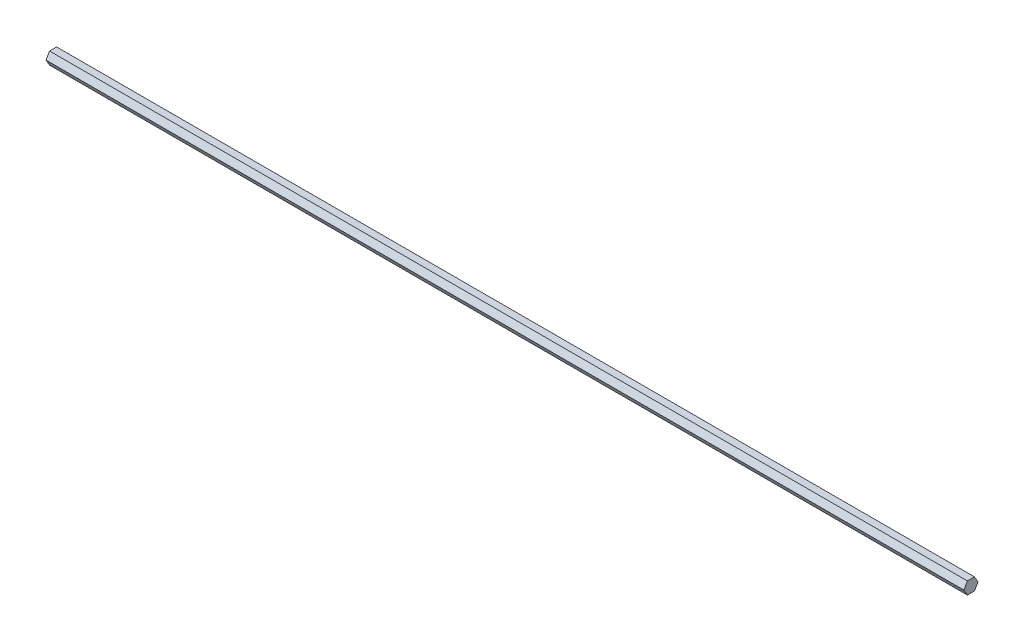
ISO-10303-21;
HEADER;
FILE_DESCRIPTION(('STEP AP214'),'2;1');
FILE_NAME('part.step','',(''),(''),'','','');
FILE_SCHEMA(('AUTOMOTIVE_DESIGN { 1 0 10303 214 1 1 1 1 }'));
ENDSEC;
DATA;
#1=APPLICATION_CONTEXT('core data for automotive mechanical design processes');
#2=APPLICATION_PROTOCOL_DEFINITION('international standard','automotive_design',2000,#1);
#3=PRODUCT_CONTEXT('',#1,'mechanical');
#4=PRODUCT('Part','Part','',(#3));
#5=PRODUCT_RELATED_PRODUCT_CATEGORY('part','',(#4));
#6=PRODUCT_DEFINITION_FORMATION('','',#4);
#7=PRODUCT_DEFINITION_CONTEXT('part definition',#1,'design');
#8=PRODUCT_DEFINITION('design','',#6,#7);
#9=PRODUCT_DEFINITION_SHAPE('','',#8);
#10=(LENGTH_UNIT() NAMED_UNIT(*) SI_UNIT(.MILLI.,.METRE.));
#11=(NAMED_UNIT(*) PLANE_ANGLE_UNIT() SI_UNIT($,.RADIAN.));
#12=(NAMED_UNIT(*) SI_UNIT($,.STERADIAN.) SOLID_ANGLE_UNIT());
#13=UNCERTAINTY_MEASURE_WITH_UNIT(LENGTH_MEASURE(1.E-05),#10,'distance_accuracy_value','');
#14=(GEOMETRIC_REPRESENTATION_CONTEXT(3) GLOBAL_UNCERTAINTY_ASSIGNED_CONTEXT((#13)) GLOBAL_UNIT_ASSIGNED_CONTEXT((#10,
#11,#12)) REPRESENTATION_CONTEXT('',''));
#15=CARTESIAN_POINT('',(0.,0.,0.));
#16=DIRECTION('',(0.,0.,1.));
#17=DIRECTION('',(1.,0.,0.));
#18=AXIS2_PLACEMENT_3D('',#15,#16,#17);
#19=CARTESIAN_POINT('',(75.,-1.,-0.577350269189626));
#20=DIRECTION('',(0.,0.5,0.866025403784439));
#21=DIRECTION('',(0.,-0.866025403784439,0.5));
#22=AXIS2_PLACEMENT_3D('',#19,#20,#21);
#23=PLANE('',#22);
#24=DIRECTION('',(0.,0.866025403784439,-0.5));
#25=VECTOR('',#24,1.);
#26=CARTESIAN_POINT('',(-75.,-1.,-0.577350269189626));
#27=LINE('',#26,#25);
#28=CARTESIAN_POINT('',(-75.,-1.,-0.577350269189626));
#29=VERTEX_POINT('',#28);
#30=CARTESIAN_POINT('',(-75.,0.,-1.15470053837925));
#31=VERTEX_POINT('',#30);
#32=EDGE_CURVE('E120',#29,#31,#27,.T.);
#33=ORIENTED_EDGE('',*,*,#32,.T.);
#34=DIRECTION('',(-1.,0.,0.));
#35=VECTOR('',#34,1.);
#36=CARTESIAN_POINT('',(75.,0.,-1.15470053837925));
#37=LINE('',#36,#35);
#38=CARTESIAN_POINT('',(75.,0.,-1.15470053837925));
#39=VERTEX_POINT('',#38);
#40=EDGE_CURVE('E11',#39,#31,#37,.T.);
#41=ORIENTED_EDGE('',*,*,#40,.F.);
#42=DIRECTION('',(0.,0.866025403784439,-0.5));
#43=VECTOR('',#42,1.);
#44=CARTESIAN_POINT('',(75.,-1.,-0.577350269189626));
#45=LINE('',#44,#43);
#46=CARTESIAN_POINT('',(75.,-1.,-0.577350269189626));
#47=VERTEX_POINT('',#46);
#48=EDGE_CURVE('E130',#47,#39,#45,.T.);
#49=ORIENTED_EDGE('',*,*,#48,.F.);
#50=DIRECTION('',(-1.,0.,0.));
#51=VECTOR('',#50,1.);
#52=CARTESIAN_POINT('',(75.,-1.,-0.577350269189626));
#53=LINE('',#52,#51);
#54=EDGE_CURVE('E116',#47,#29,#53,.T.);
#55=ORIENTED_EDGE('',*,*,#54,.T.);
#56=EDGE_LOOP('',(#33,#41,#49,#55));
#57=FACE_BOUND('',#56,.T.);
#58=ADVANCED_FACE('F36',(#57),#23,.F.);
#59=CARTESIAN_POINT('',(75.,0.,-1.15470053837925));
#60=DIRECTION('',(0.,-0.5,0.866025403784439));
#61=DIRECTION('',(0.,-0.866025403784439,-0.5));
#62=AXIS2_PLACEMENT_3D('',#59,#60,#61);
#63=PLANE('',#62);
#64=DIRECTION('',(0.,0.866025403784439,0.5));
#65=VECTOR('',#64,1.);
#66=CARTESIAN_POINT('',(-75.,0.,-1.15470053837925));
#67=LINE('',#66,#65);
#68=CARTESIAN_POINT('',(-75.,1.,-0.577350269189625));
#69=VERTEX_POINT('',#68);
#70=EDGE_CURVE('E123',#31,#69,#67,.T.);
#71=ORIENTED_EDGE('',*,*,#70,.T.);
#72=DIRECTION('',(-1.,0.,0.));
#73=VECTOR('',#72,1.);
#74=CARTESIAN_POINT('',(75.,1.,-0.577350269189625));
#75=LINE('',#74,#73);
#76=CARTESIAN_POINT('',(75.,1.,-0.577350269189625));
#77=VERTEX_POINT('',#76);
#78=EDGE_CURVE('E44',#77,#69,#75,.T.);
#79=ORIENTED_EDGE('',*,*,#78,.F.);
#80=DIRECTION('',(0.,0.866025403784439,0.5));
#81=VECTOR('',#80,1.);
#82=CARTESIAN_POINT('',(75.,0.,-1.15470053837925));
#83=LINE('',#82,#81);
#84=EDGE_CURVE('E89',#39,#77,#83,.T.);
#85=ORIENTED_EDGE('',*,*,#84,.F.);
#86=ORIENTED_EDGE('',*,*,#40,.T.);
#87=EDGE_LOOP('',(#71,#79,#85,#86));
#88=FACE_BOUND('',#87,.T.);
#89=ADVANCED_FACE('F154',(#88),#63,.F.);
#90=CARTESIAN_POINT('',(75.,1.,-0.577350269189625));
#91=DIRECTION('',(0.,-1.,0.));
#92=DIRECTION('',(0.,0.,-1.));
#93=AXIS2_PLACEMENT_3D('',#90,#91,#92);
#94=PLANE('',#93);
#95=DIRECTION('',(0.,0.,1.));
#96=VECTOR('',#95,1.);
#97=CARTESIAN_POINT('',(-75.,1.,-0.577350269189625));
#98=LINE('',#97,#96);
#99=CARTESIAN_POINT('',(-75.,1.,0.577350269189626));
#100=VERTEX_POINT('',#99);
#101=EDGE_CURVE('E125',#69,#100,#98,.T.);
#102=ORIENTED_EDGE('',*,*,#101,.T.);
#103=DIRECTION('',(-1.,0.,0.));
#104=VECTOR('',#103,1.);
#105=CARTESIAN_POINT('',(75.,1.,0.577350269189626));
#106=LINE('',#105,#104);
#107=CARTESIAN_POINT('',(75.,1.,0.577350269189626));
#108=VERTEX_POINT('',#107);
#109=EDGE_CURVE('E111',#108,#100,#106,.T.);
#110=ORIENTED_EDGE('',*,*,#109,.F.);
#111=DIRECTION('',(0.,0.,1.));
#112=VECTOR('',#111,1.);
#113=CARTESIAN_POINT('',(75.,1.,-0.577350269189625));
#114=LINE('',#113,#112);
#115=EDGE_CURVE('E102',#77,#108,#114,.T.);
#116=ORIENTED_EDGE('',*,*,#115,.F.);
#117=ORIENTED_EDGE('',*,*,#78,.T.);
#118=EDGE_LOOP('',(#102,#110,#116,#117));
#119=FACE_BOUND('',#118,.T.);
#120=ADVANCED_FACE('F136',(#119),#94,.F.);
#121=CARTESIAN_POINT('',(75.,1.,0.577350269189626));
#122=DIRECTION('',(0.,-0.5,-0.866025403784439));
#123=DIRECTION('',(0.,0.866025403784439,-0.5));
#124=AXIS2_PLACEMENT_3D('',#121,#122,#123);
#125=PLANE('',#124);
#126=DIRECTION('',(0.,-0.866025403784439,0.5));
#127=VECTOR('',#126,1.);
#128=CARTESIAN_POINT('',(-75.,1.,0.577350269189626));
#129=LINE('',#128,#127);
#130=CARTESIAN_POINT('',(-75.,0.,1.15470053837925));
#131=VERTEX_POINT('',#130);
#132=EDGE_CURVE('E110',#100,#131,#129,.T.);
#133=ORIENTED_EDGE('',*,*,#132,.T.);
#134=DIRECTION('',(-1.,0.,0.));
#135=VECTOR('',#134,1.);
#136=CARTESIAN_POINT('',(75.,0.,1.15470053837925));
#137=LINE('',#136,#135);
#138=CARTESIAN_POINT('',(75.,0.,1.15470053837925));
#139=VERTEX_POINT('',#138);
#140=EDGE_CURVE('E107',#139,#131,#137,.T.);
#141=ORIENTED_EDGE('',*,*,#140,.F.);
#142=DIRECTION('',(0.,-0.866025403784439,0.5));
#143=VECTOR('',#142,1.);
#144=CARTESIAN_POINT('',(75.,1.,0.577350269189626));
#145=LINE('',#144,#143);
#146=EDGE_CURVE('E96',#108,#139,#145,.T.);
#147=ORIENTED_EDGE('',*,*,#146,.F.);
#148=ORIENTED_EDGE('',*,*,#109,.T.);
#149=EDGE_LOOP('',(#133,#141,#147,#148));
#150=FACE_BOUND('',#149,.T.);
#151=ADVANCED_FACE('F108',(#150),#125,.F.);
#152=CARTESIAN_POINT('',(75.,0.,1.15470053837925));
#153=DIRECTION('',(0.,0.5,-0.866025403784439));
#154=DIRECTION('',(0.,0.866025403784439,0.5));
#155=AXIS2_PLACEMENT_3D('',#152,#153,#154);
#156=PLANE('',#155);
#157=DIRECTION('',(0.,-0.866025403784439,-0.5));
#158=VECTOR('',#157,1.);
#159=CARTESIAN_POINT('',(-75.,0.,1.15470053837925));
#160=LINE('',#159,#158);
#161=CARTESIAN_POINT('',(-75.,-1.,0.577350269189626));
#162=VERTEX_POINT('',#161);
#163=EDGE_CURVE('E75',#131,#162,#160,.T.);
#164=ORIENTED_EDGE('',*,*,#163,.T.);
#165=DIRECTION('',(-1.,0.,0.));
#166=VECTOR('',#165,1.);
#167=CARTESIAN_POINT('',(75.,-1.,0.577350269189626));
#168=LINE('',#167,#166);
#169=CARTESIAN_POINT('',(75.,-1.,0.577350269189626));
#170=VERTEX_POINT('',#169);
#171=EDGE_CURVE('E112',#170,#162,#168,.T.);
#172=ORIENTED_EDGE('',*,*,#171,.F.);
#173=DIRECTION('',(0.,-0.866025403784439,-0.5));
#174=VECTOR('',#173,1.);
#175=CARTESIAN_POINT('',(75.,0.,1.15470053837925));
#176=LINE('',#175,#174);
#177=EDGE_CURVE('E100',#139,#170,#176,.T.);
#178=ORIENTED_EDGE('',*,*,#177,.F.);
#179=ORIENTED_EDGE('',*,*,#140,.T.);
#180=EDGE_LOOP('',(#164,#172,#178,#179));
#181=FACE_BOUND('',#180,.T.);
#182=ADVANCED_FACE('F114',(#181),#156,.F.);
#183=CARTESIAN_POINT('',(75.,-1.,0.577350269189626));
#184=DIRECTION('',(0.,1.,0.));
#185=DIRECTION('',(0.,0.,1.));
#186=AXIS2_PLACEMENT_3D('',#183,#184,#185);
#187=PLANE('',#186);
#188=DIRECTION('',(0.,0.,-1.));
#189=VECTOR('',#188,1.);
#190=CARTESIAN_POINT('',(-75.,-1.,0.577350269189626));
#191=LINE('',#190,#189);
#192=EDGE_CURVE('E81',#162,#29,#191,.T.);
#193=ORIENTED_EDGE('',*,*,#192,.T.);
#194=ORIENTED_EDGE('',*,*,#54,.F.);
#195=DIRECTION('',(0.,0.,-1.));
#196=VECTOR('',#195,1.);
#197=CARTESIAN_POINT('',(75.,-1.,0.577350269189626));
#198=LINE('',#197,#196);
#199=EDGE_CURVE('E52',#170,#47,#198,.T.);
#200=ORIENTED_EDGE('',*,*,#199,.F.);
#201=ORIENTED_EDGE('',*,*,#171,.T.);
#202=EDGE_LOOP('',(#193,#194,#200,#201));
#203=FACE_BOUND('',#202,.T.);
#204=ADVANCED_FACE('F143',(#203),#187,.F.);
#205=CARTESIAN_POINT('',(75.,0.,0.));
#206=DIRECTION('',(1.,0.,0.));
#207=DIRECTION('',(0.,0.,-1.));
#208=AXIS2_PLACEMENT_3D('',#205,#206,#207);
#209=PLANE('',#208);
#210=ORIENTED_EDGE('',*,*,#48,.T.);
#211=ORIENTED_EDGE('',*,*,#84,.T.);
#212=ORIENTED_EDGE('',*,*,#115,.T.);
#213=ORIENTED_EDGE('',*,*,#146,.T.);
#214=ORIENTED_EDGE('',*,*,#177,.T.);
#215=ORIENTED_EDGE('',*,*,#199,.T.);
#216=EDGE_LOOP('',(#210,#211,#212,#213,#214,#215));
#217=FACE_BOUND('',#216,.T.);
#218=ADVANCED_FACE('F98',(#217),#209,.T.);
#219=CARTESIAN_POINT('',(-75.,0.,0.));
#220=DIRECTION('',(1.,0.,0.));
#221=DIRECTION('',(0.,0.,-1.));
#222=AXIS2_PLACEMENT_3D('',#219,#220,#221);
#223=PLANE('',#222);
#224=ORIENTED_EDGE('',*,*,#32,.F.);
#225=ORIENTED_EDGE('',*,*,#192,.F.);
#226=ORIENTED_EDGE('',*,*,#163,.F.);
#227=ORIENTED_EDGE('',*,*,#132,.F.);
#228=ORIENTED_EDGE('',*,*,#101,.F.);
#229=ORIENTED_EDGE('',*,*,#70,.F.);
#230=EDGE_LOOP('',(#224,#225,#226,#227,#228,#229));
#231=FACE_BOUND('',#230,.T.);
#232=ADVANCED_FACE('F139',(#231),#223,.F.);
#233=CLOSED_SHELL('',(#58,#89,#120,#151,#182,#204,#218,#232));
#234=MANIFOLD_SOLID_BREP('B2',#233);
#235=ADVANCED_BREP_SHAPE_REPRESENTATION('',(#18,#234),#14);
#236=SHAPE_DEFINITION_REPRESENTATION(#9,#235);
ENDSEC;
END-ISO-10303-21;
